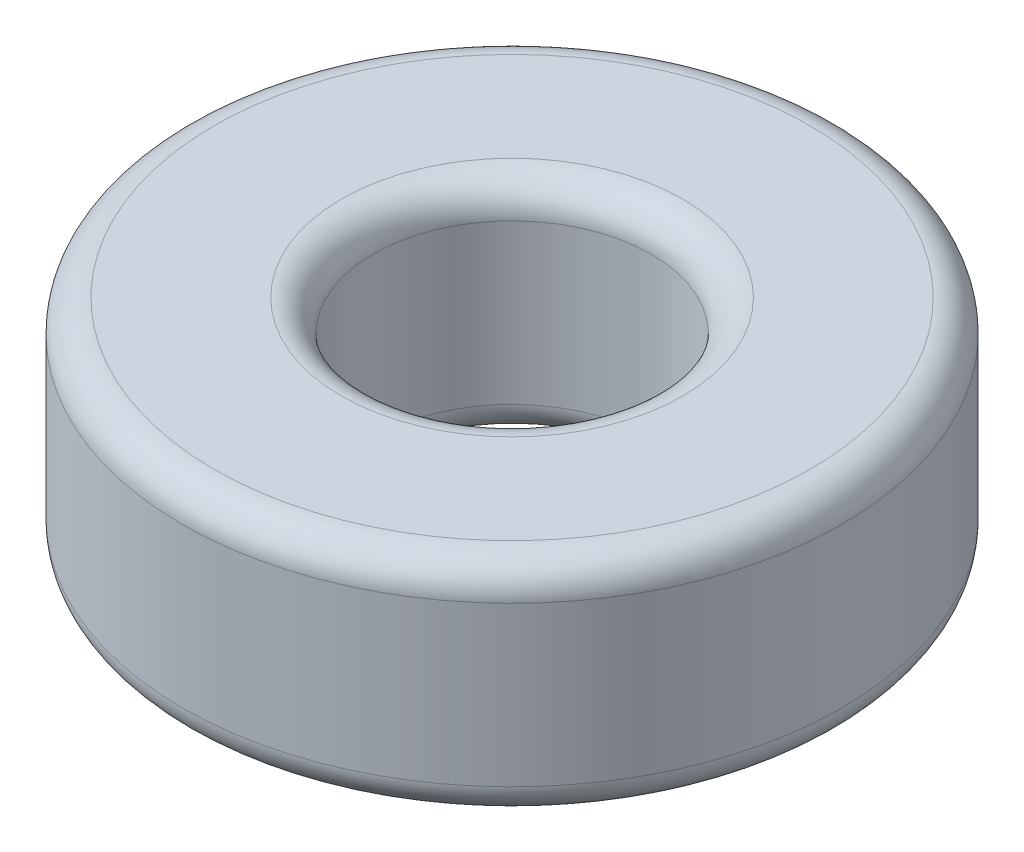
ISO-10303-21;
HEADER;
FILE_DESCRIPTION(('STEP AP214'),'2;1');
FILE_NAME('part.step','',(''),(''),'','','');
FILE_SCHEMA(('AUTOMOTIVE_DESIGN { 1 0 10303 214 1 1 1 1 }'));
ENDSEC;
DATA;
#1=APPLICATION_CONTEXT('core data for automotive mechanical design processes');
#2=APPLICATION_PROTOCOL_DEFINITION('international standard','automotive_design',2000,#1);
#3=PRODUCT_CONTEXT('',#1,'mechanical');
#4=PRODUCT('Part','Part','',(#3));
#5=PRODUCT_RELATED_PRODUCT_CATEGORY('part','',(#4));
#6=PRODUCT_DEFINITION_FORMATION('','',#4);
#7=PRODUCT_DEFINITION_CONTEXT('part definition',#1,'design');
#8=PRODUCT_DEFINITION('design','',#6,#7);
#9=PRODUCT_DEFINITION_SHAPE('','',#8);
#10=(LENGTH_UNIT() NAMED_UNIT(*) SI_UNIT(.MILLI.,.METRE.));
#11=(NAMED_UNIT(*) PLANE_ANGLE_UNIT() SI_UNIT($,.RADIAN.));
#12=(NAMED_UNIT(*) SI_UNIT($,.STERADIAN.) SOLID_ANGLE_UNIT());
#13=UNCERTAINTY_MEASURE_WITH_UNIT(LENGTH_MEASURE(1.E-05),#10,'distance_accuracy_value','');
#14=(GEOMETRIC_REPRESENTATION_CONTEXT(3) GLOBAL_UNCERTAINTY_ASSIGNED_CONTEXT((#13)) GLOBAL_UNIT_ASSIGNED_CONTEXT((#10,
#11,#12)) REPRESENTATION_CONTEXT('',''));
#15=CARTESIAN_POINT('',(0.,0.,0.));
#16=DIRECTION('',(0.,0.,1.));
#17=DIRECTION('',(1.,0.,0.));
#18=AXIS2_PLACEMENT_3D('',#15,#16,#17);
#19=CARTESIAN_POINT('',(0.,3.5,0.));
#20=DIRECTION('',(0.,1.,0.));
#21=DIRECTION('',(0.,0.,1.));
#22=AXIS2_PLACEMENT_3D('',#19,#20,#21);
#23=PLANE('',#22);
#24=CARTESIAN_POINT('',(0.,3.5,0.));
#25=DIRECTION('',(0.,1.,0.));
#26=DIRECTION('',(0.,0.,1.));
#27=AXIS2_PLACEMENT_3D('',#24,#25,#26);
#28=CIRCLE('',#27,2.6844);
#29=CARTESIAN_POINT('',(0.,3.5,2.6844));
#30=VERTEX_POINT('',#29);
#31=EDGE_CURVE('E10',#30,#30,#28,.F.);
#32=ORIENTED_EDGE('',*,*,#31,.T.);
#33=EDGE_LOOP('',(#32));
#34=FACE_BOUND('',#33,.T.);
#35=CARTESIAN_POINT('',(0.,3.5,0.));
#36=DIRECTION('',(0.,1.,0.));
#37=DIRECTION('',(0.,0.,1.));
#38=AXIS2_PLACEMENT_3D('',#35,#36,#37);
#39=CIRCLE('',#38,4.6844);
#40=CARTESIAN_POINT('',(0.,3.5,4.6844));
#41=VERTEX_POINT('',#40);
#42=EDGE_CURVE('E48',#41,#41,#39,.T.);
#43=ORIENTED_EDGE('',*,*,#42,.T.);
#44=EDGE_LOOP('',(#43));
#45=FACE_BOUND('',#44,.T.);
#46=ADVANCED_FACE('F40',(#34,#45),#23,.T.);
#47=CARTESIAN_POINT('',(0.,0.,0.));
#48=DIRECTION('',(0.,1.,0.));
#49=DIRECTION('',(0.,0.,1.));
#50=AXIS2_PLACEMENT_3D('',#47,#48,#49);
#51=PLANE('',#50);
#52=CARTESIAN_POINT('',(0.,0.,0.));
#53=DIRECTION('',(0.,1.,0.));
#54=DIRECTION('',(0.,0.,1.));
#55=AXIS2_PLACEMENT_3D('',#52,#53,#54);
#56=CIRCLE('',#55,2.6844);
#57=CARTESIAN_POINT('',(0.,0.,2.6844));
#58=VERTEX_POINT('',#57);
#59=EDGE_CURVE('E74',#58,#58,#56,.T.);
#60=ORIENTED_EDGE('',*,*,#59,.T.);
#61=EDGE_LOOP('',(#60));
#62=FACE_BOUND('',#61,.T.);
#63=CARTESIAN_POINT('',(0.,0.,0.));
#64=DIRECTION('',(0.,1.,0.));
#65=DIRECTION('',(0.,0.,1.));
#66=AXIS2_PLACEMENT_3D('',#63,#64,#65);
#67=CIRCLE('',#66,4.6844);
#68=CARTESIAN_POINT('',(0.,0.,4.6844));
#69=VERTEX_POINT('',#68);
#70=EDGE_CURVE('E78',#69,#69,#67,.F.);
#71=ORIENTED_EDGE('',*,*,#70,.T.);
#72=EDGE_LOOP('',(#71));
#73=FACE_BOUND('',#72,.T.);
#74=ADVANCED_FACE('F84',(#62,#73),#51,.F.);
#75=CARTESIAN_POINT('',(0.,3.5,0.));
#76=DIRECTION('',(0.,-1.,0.));
#77=DIRECTION('',(0.,0.,-1.));
#78=AXIS2_PLACEMENT_3D('',#75,#76,#77);
#79=CYLINDRICAL_SURFACE('',#78,5.1844);
#80=CARTESIAN_POINT('',(0.,0.5,0.));
#81=DIRECTION('',(0.,1.,0.));
#82=DIRECTION('',(0.,0.,1.));
#83=AXIS2_PLACEMENT_3D('',#80,#81,#82);
#84=CIRCLE('',#83,5.1844);
#85=CARTESIAN_POINT('',(0.,0.5,5.1844));
#86=VERTEX_POINT('',#85);
#87=EDGE_CURVE('E54',#86,#86,#84,.T.);
#88=ORIENTED_EDGE('',*,*,#87,.T.);
#89=EDGE_LOOP('',(#88));
#90=FACE_BOUND('',#89,.T.);
#91=CARTESIAN_POINT('',(0.,3.,0.));
#92=DIRECTION('',(0.,1.,0.));
#93=DIRECTION('',(0.,0.,1.));
#94=AXIS2_PLACEMENT_3D('',#91,#92,#93);
#95=CIRCLE('',#94,5.1844);
#96=CARTESIAN_POINT('',(0.,3.,5.1844));
#97=VERTEX_POINT('',#96);
#98=EDGE_CURVE('E60',#97,#97,#95,.F.);
#99=ORIENTED_EDGE('',*,*,#98,.T.);
#100=EDGE_LOOP('',(#99));
#101=FACE_BOUND('',#100,.T.);
#102=ADVANCED_FACE('F94',(#90,#101),#79,.T.);
#103=CARTESIAN_POINT('',(0.,3.5,0.));
#104=DIRECTION('',(0.,-1.,0.));
#105=DIRECTION('',(0.,0.,-1.));
#106=AXIS2_PLACEMENT_3D('',#103,#104,#105);
#107=CYLINDRICAL_SURFACE('',#106,2.1844);
#108=CARTESIAN_POINT('',(0.,0.5,0.));
#109=DIRECTION('',(0.,1.,0.));
#110=DIRECTION('',(0.,0.,1.));
#111=AXIS2_PLACEMENT_3D('',#108,#109,#110);
#112=CIRCLE('',#111,2.1844);
#113=CARTESIAN_POINT('',(0.,0.5,2.1844));
#114=VERTEX_POINT('',#113);
#115=EDGE_CURVE('E66',#114,#114,#112,.F.);
#116=ORIENTED_EDGE('',*,*,#115,.T.);
#117=EDGE_LOOP('',(#116));
#118=FACE_BOUND('',#117,.T.);
#119=CARTESIAN_POINT('',(0.,3.,0.));
#120=DIRECTION('',(0.,1.,0.));
#121=DIRECTION('',(0.,0.,1.));
#122=AXIS2_PLACEMENT_3D('',#119,#120,#121);
#123=CIRCLE('',#122,2.1844);
#124=CARTESIAN_POINT('',(0.,3.,2.1844));
#125=VERTEX_POINT('',#124);
#126=EDGE_CURVE('E70',#125,#125,#123,.T.);
#127=ORIENTED_EDGE('',*,*,#126,.T.);
#128=EDGE_LOOP('',(#127));
#129=FACE_BOUND('',#128,.T.);
#130=ADVANCED_FACE('F97',(#118,#129),#107,.F.);
#131=CARTESIAN_POINT('',(0.,0.5,0.));
#132=DIRECTION('',(0.,1.,0.));
#133=DIRECTION('',(0.,0.,1.));
#134=AXIS2_PLACEMENT_3D('',#131,#132,#133);
#135=TOROIDAL_SURFACE('',#134,2.6844,0.5);
#136=ORIENTED_EDGE('',*,*,#115,.F.);
#137=EDGE_LOOP('',(#136));
#138=FACE_BOUND('',#137,.T.);
#139=ORIENTED_EDGE('',*,*,#59,.F.);
#140=EDGE_LOOP('',(#139));
#141=FACE_BOUND('',#140,.T.);
#142=ADVANCED_FACE('F90',(#138,#141),#135,.T.);
#143=CARTESIAN_POINT('',(0.,0.5,0.));
#144=DIRECTION('',(0.,1.,0.));
#145=DIRECTION('',(0.,0.,1.));
#146=AXIS2_PLACEMENT_3D('',#143,#144,#145);
#147=TOROIDAL_SURFACE('',#146,4.6844,0.5);
#148=ORIENTED_EDGE('',*,*,#70,.F.);
#149=EDGE_LOOP('',(#148));
#150=FACE_BOUND('',#149,.T.);
#151=ORIENTED_EDGE('',*,*,#87,.F.);
#152=EDGE_LOOP('',(#151));
#153=FACE_BOUND('',#152,.T.);
#154=ADVANCED_FACE('F86',(#150,#153),#147,.T.);
#155=CARTESIAN_POINT('',(0.,3.,0.));
#156=DIRECTION('',(0.,1.,0.));
#157=DIRECTION('',(0.,0.,1.));
#158=AXIS2_PLACEMENT_3D('',#155,#156,#157);
#159=TOROIDAL_SURFACE('',#158,2.6844,0.5);
#160=ORIENTED_EDGE('',*,*,#31,.F.);
#161=EDGE_LOOP('',(#160));
#162=FACE_BOUND('',#161,.T.);
#163=ORIENTED_EDGE('',*,*,#126,.F.);
#164=EDGE_LOOP('',(#163));
#165=FACE_BOUND('',#164,.T.);
#166=ADVANCED_FACE('F89',(#162,#165),#159,.T.);
#167=CARTESIAN_POINT('',(0.,3.,0.));
#168=DIRECTION('',(0.,1.,0.));
#169=DIRECTION('',(0.,0.,1.));
#170=AXIS2_PLACEMENT_3D('',#167,#168,#169);
#171=TOROIDAL_SURFACE('',#170,4.6844,0.5);
#172=ORIENTED_EDGE('',*,*,#98,.F.);
#173=EDGE_LOOP('',(#172));
#174=FACE_BOUND('',#173,.T.);
#175=ORIENTED_EDGE('',*,*,#42,.F.);
#176=EDGE_LOOP('',(#175));
#177=FACE_BOUND('',#176,.T.);
#178=ADVANCED_FACE('F42',(#174,#177),#171,.T.);
#179=CLOSED_SHELL('',(#46,#74,#102,#130,#142,#154,#166,#178));
#180=MANIFOLD_SOLID_BREP('B2',#179);
#181=ADVANCED_BREP_SHAPE_REPRESENTATION('',(#18,#180),#14);
#182=SHAPE_DEFINITION_REPRESENTATION(#9,#181);
ENDSEC;
END-ISO-10303-21;
